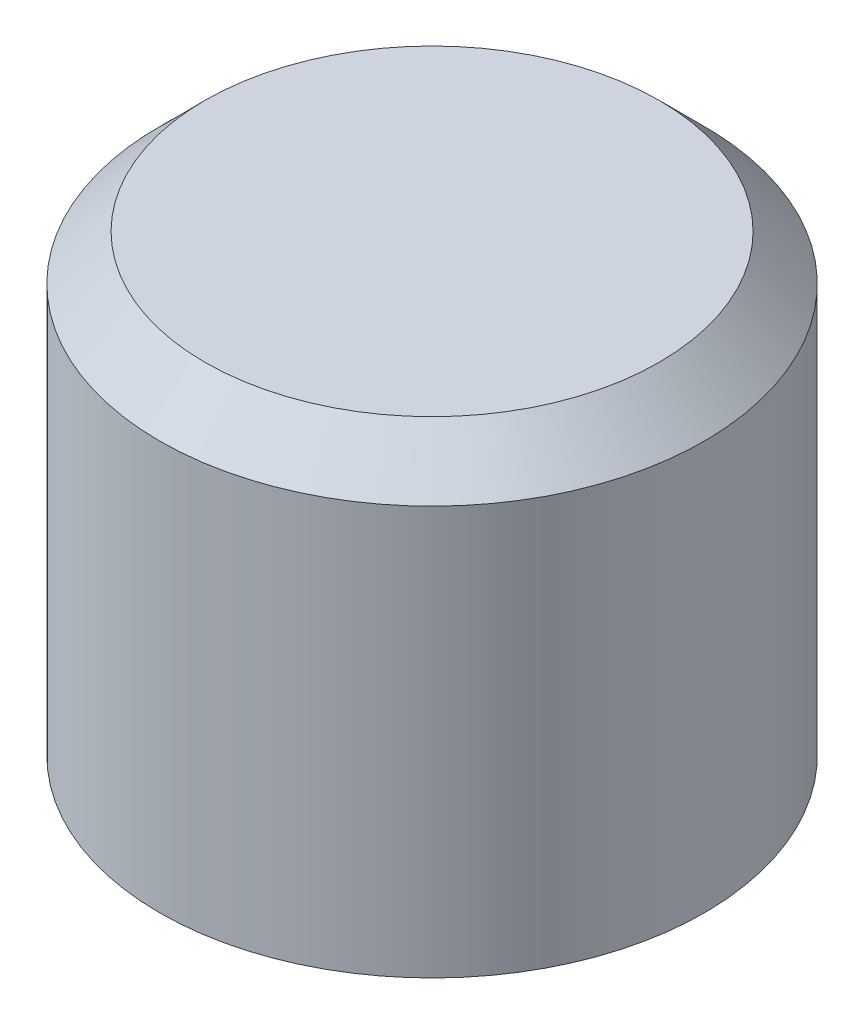
ISO-10303-21;
HEADER;
FILE_DESCRIPTION(('STEP AP214'),'2;1');
FILE_NAME('part.step','',(''),(''),'','','');
FILE_SCHEMA(('AUTOMOTIVE_DESIGN { 1 0 10303 214 1 1 1 1 }'));
ENDSEC;
DATA;
#1=APPLICATION_CONTEXT('core data for automotive mechanical design processes');
#2=APPLICATION_PROTOCOL_DEFINITION('international standard','automotive_design',2000,#1);
#3=PRODUCT_CONTEXT('',#1,'mechanical');
#4=PRODUCT('Part','Part','',(#3));
#5=PRODUCT_RELATED_PRODUCT_CATEGORY('part','',(#4));
#6=PRODUCT_DEFINITION_FORMATION('','',#4);
#7=PRODUCT_DEFINITION_CONTEXT('part definition',#1,'design');
#8=PRODUCT_DEFINITION('design','',#6,#7);
#9=PRODUCT_DEFINITION_SHAPE('','',#8);
#10=(LENGTH_UNIT() NAMED_UNIT(*) SI_UNIT(.MILLI.,.METRE.));
#11=(NAMED_UNIT(*) PLANE_ANGLE_UNIT() SI_UNIT($,.RADIAN.));
#12=(NAMED_UNIT(*) SI_UNIT($,.STERADIAN.) SOLID_ANGLE_UNIT());
#13=UNCERTAINTY_MEASURE_WITH_UNIT(LENGTH_MEASURE(1.E-05),#10,'distance_accuracy_value','');
#14=(GEOMETRIC_REPRESENTATION_CONTEXT(3) GLOBAL_UNCERTAINTY_ASSIGNED_CONTEXT((#13)) GLOBAL_UNIT_ASSIGNED_CONTEXT((#10,
#11,#12)) REPRESENTATION_CONTEXT('',''));
#15=CARTESIAN_POINT('',(0.,0.,0.));
#16=DIRECTION('',(0.,0.,1.));
#17=DIRECTION('',(1.,0.,0.));
#18=AXIS2_PLACEMENT_3D('',#15,#16,#17);
#19=CARTESIAN_POINT('',(0.,10.,0.));
#20=DIRECTION('',(0.,-1.,0.));
#21=DIRECTION('',(0.,0.,-1.));
#22=AXIS2_PLACEMENT_3D('',#19,#20,#21);
#23=CYLINDRICAL_SURFACE('',#22,6.);
#24=CARTESIAN_POINT('',(0.,8.99999999999999,0.));
#25=DIRECTION('',(0.,1.,0.));
#26=DIRECTION('',(0.,0.,1.));
#27=AXIS2_PLACEMENT_3D('',#24,#25,#26);
#28=CIRCLE('',#27,6.);
#29=CARTESIAN_POINT('',(0.,8.99999999999999,6.));
#30=VERTEX_POINT('',#29);
#31=EDGE_CURVE('E10',#30,#30,#28,.F.);
#32=ORIENTED_EDGE('',*,*,#31,.T.);
#33=EDGE_LOOP('',(#32));
#34=FACE_BOUND('',#33,.T.);
#35=CARTESIAN_POINT('',(0.,0.,0.));
#36=DIRECTION('',(0.,1.,0.));
#37=DIRECTION('',(0.,0.,1.));
#38=AXIS2_PLACEMENT_3D('',#35,#36,#37);
#39=CIRCLE('',#38,6.);
#40=CARTESIAN_POINT('',(0.,0.,6.));
#41=VERTEX_POINT('',#40);
#42=EDGE_CURVE('E50',#41,#41,#39,.T.);
#43=ORIENTED_EDGE('',*,*,#42,.T.);
#44=EDGE_LOOP('',(#43));
#45=FACE_BOUND('',#44,.T.);
#46=ADVANCED_FACE('F37',(#34,#45),#23,.T.);
#47=CARTESIAN_POINT('',(0.,10.,0.));
#48=DIRECTION('',(0.,1.,0.));
#49=DIRECTION('',(0.,0.,1.));
#50=AXIS2_PLACEMENT_3D('',#47,#48,#49);
#51=PLANE('',#50);
#52=CARTESIAN_POINT('',(0.,10.,0.));
#53=DIRECTION('',(0.,1.,0.));
#54=DIRECTION('',(0.,0.,1.));
#55=AXIS2_PLACEMENT_3D('',#52,#53,#54);
#56=CIRCLE('',#55,5.);
#57=CARTESIAN_POINT('',(0.,10.,5.));
#58=VERTEX_POINT('',#57);
#59=EDGE_CURVE('E45',#58,#58,#56,.T.);
#60=ORIENTED_EDGE('',*,*,#59,.T.);
#61=EDGE_LOOP('',(#60));
#62=FACE_BOUND('',#61,.T.);
#63=ADVANCED_FACE('F77',(#62),#51,.T.);
#64=CARTESIAN_POINT('',(0.,0.,0.));
#65=DIRECTION('',(0.,1.,0.));
#66=DIRECTION('',(0.,0.,1.));
#67=AXIS2_PLACEMENT_3D('',#64,#65,#66);
#68=PLANE('',#67);
#69=CARTESIAN_POINT('',(0.,0.,0.));
#70=DIRECTION('',(0.,-1.,0.));
#71=DIRECTION('',(0.,0.,-1.));
#72=AXIS2_PLACEMENT_3D('',#69,#70,#71);
#73=CIRCLE('',#72,4.);
#74=CARTESIAN_POINT('',(0.,0.,-4.));
#75=VERTEX_POINT('',#74);
#76=EDGE_CURVE('E58',#75,#75,#73,.T.);
#77=ORIENTED_EDGE('',*,*,#76,.F.);
#78=EDGE_LOOP('',(#77));
#79=FACE_BOUND('',#78,.T.);
#80=ORIENTED_EDGE('',*,*,#42,.F.);
#81=EDGE_LOOP('',(#80));
#82=FACE_BOUND('',#81,.T.);
#83=ADVANCED_FACE('F74',(#79,#82),#68,.F.);
#84=CARTESIAN_POINT('',(0.,10.,0.));
#85=DIRECTION('',(0.,-1.,0.));
#86=DIRECTION('',(0.,0.,-1.));
#87=AXIS2_PLACEMENT_3D('',#84,#85,#86);
#88=CONICAL_SURFACE('',#87,5.,0.785398163397447);
#89=ORIENTED_EDGE('',*,*,#31,.F.);
#90=EDGE_LOOP('',(#89));
#91=FACE_BOUND('',#90,.T.);
#92=ORIENTED_EDGE('',*,*,#59,.F.);
#93=EDGE_LOOP('',(#92));
#94=FACE_BOUND('',#93,.T.);
#95=ADVANCED_FACE('F39',(#91,#94),#88,.T.);
#96=CARTESIAN_POINT('',(0.,7.,0.));
#97=DIRECTION('',(0.,-1.,0.));
#98=DIRECTION('',(0.,0.,-1.));
#99=AXIS2_PLACEMENT_3D('',#96,#97,#98);
#100=CYLINDRICAL_SURFACE('',#99,4.);
#101=CARTESIAN_POINT('',(0.,7.,0.));
#102=DIRECTION('',(0.,-1.,0.));
#103=DIRECTION('',(0.,0.,-1.));
#104=AXIS2_PLACEMENT_3D('',#101,#102,#103);
#105=CIRCLE('',#104,4.);
#106=CARTESIAN_POINT('',(0.,7.,-4.));
#107=VERTEX_POINT('',#106);
#108=EDGE_CURVE('E55',#107,#107,#105,.T.);
#109=ORIENTED_EDGE('',*,*,#108,.F.);
#110=EDGE_LOOP('',(#109));
#111=FACE_BOUND('',#110,.T.);
#112=ORIENTED_EDGE('',*,*,#76,.T.);
#113=EDGE_LOOP('',(#112));
#114=FACE_BOUND('',#113,.T.);
#115=ADVANCED_FACE('F68',(#111,#114),#100,.F.);
#116=CARTESIAN_POINT('',(0.,7.,0.));
#117=DIRECTION('',(0.,-1.,0.));
#118=DIRECTION('',(0.,0.,-1.));
#119=AXIS2_PLACEMENT_3D('',#116,#117,#118);
#120=PLANE('',#119);
#121=ORIENTED_EDGE('',*,*,#108,.T.);
#122=EDGE_LOOP('',(#121));
#123=FACE_BOUND('',#122,.T.);
#124=ADVANCED_FACE('F66',(#123),#120,.T.);
#125=CLOSED_SHELL('',(#46,#63,#83,#95,#115,#124));
#126=MANIFOLD_SOLID_BREP('B2',#125);
#127=ADVANCED_BREP_SHAPE_REPRESENTATION('',(#18,#126),#14);
#128=SHAPE_DEFINITION_REPRESENTATION(#9,#127);
ENDSEC;
END-ISO-10303-21;
